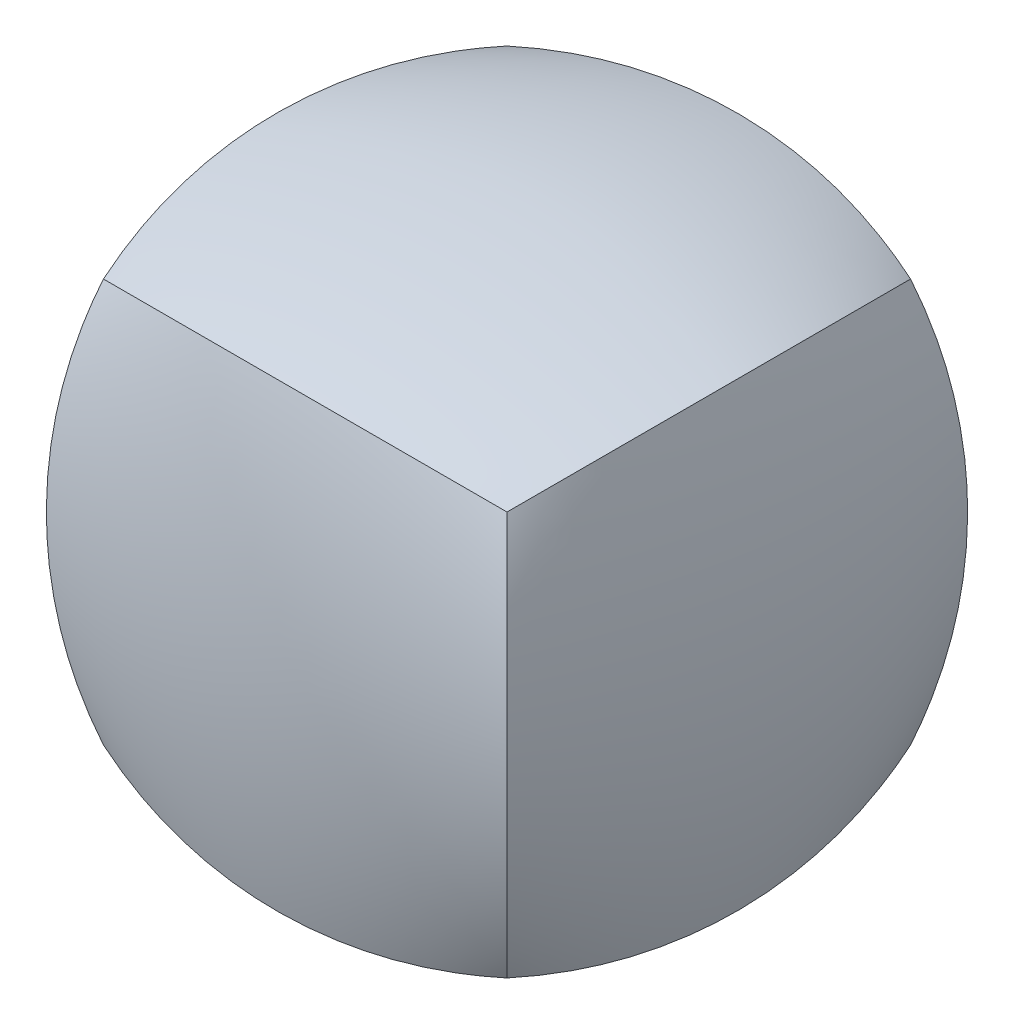
ISO-10303-21;
HEADER;
FILE_DESCRIPTION(('STEP AP214'),'2;1');
FILE_NAME('part.step','',(''),(''),'','','');
FILE_SCHEMA(('AUTOMOTIVE_DESIGN { 1 0 10303 214 1 1 1 1 }'));
ENDSEC;
DATA;
#1=APPLICATION_CONTEXT('core data for automotive mechanical design processes');
#2=APPLICATION_PROTOCOL_DEFINITION('international standard','automotive_design',2000,#1);
#3=PRODUCT_CONTEXT('',#1,'mechanical');
#4=PRODUCT('Part','Part','',(#3));
#5=PRODUCT_RELATED_PRODUCT_CATEGORY('part','',(#4));
#6=PRODUCT_DEFINITION_FORMATION('','',#4);
#7=PRODUCT_DEFINITION_CONTEXT('part definition',#1,'design');
#8=PRODUCT_DEFINITION('design','',#6,#7);
#9=PRODUCT_DEFINITION_SHAPE('','',#8);
#10=(LENGTH_UNIT() NAMED_UNIT(*) SI_UNIT(.MILLI.,.METRE.));
#11=(NAMED_UNIT(*) PLANE_ANGLE_UNIT() SI_UNIT($,.RADIAN.));
#12=(NAMED_UNIT(*) SI_UNIT($,.STERADIAN.) SOLID_ANGLE_UNIT());
#13=UNCERTAINTY_MEASURE_WITH_UNIT(LENGTH_MEASURE(1.E-05),#10,'distance_accuracy_value','');
#14=(GEOMETRIC_REPRESENTATION_CONTEXT(3) GLOBAL_UNCERTAINTY_ASSIGNED_CONTEXT((#13)) GLOBAL_UNIT_ASSIGNED_CONTEXT((#10,
#11,#12)) REPRESENTATION_CONTEXT('',''));
#15=CARTESIAN_POINT('',(0.,0.,0.));
#16=DIRECTION('',(0.,0.,1.));
#17=DIRECTION('',(1.,0.,0.));
#18=AXIS2_PLACEMENT_3D('',#15,#16,#17);
#19=CARTESIAN_POINT('',(12.6999999999999,-12.7000000000001,12.7000000000001));
#20=CARTESIAN_POINT('',(10.6944611119251,-13.290887561538,13.290887561538));
#21=CARTESIAN_POINT('',(6.51798434849319,-14.1918967287505,14.1918967287506));
#22=CARTESIAN_POINT('',(-2.10708044185823E-13,-14.6481905193401,14.6481905193401));
#23=CARTESIAN_POINT('',(-6.51798434849355,-14.1918967287504,14.1918967287505));
#24=CARTESIAN_POINT('',(-10.6944611119254,-13.2908875615378,13.2908875615378));
#25=CARTESIAN_POINT('',(-12.7000000000002,-12.6999999999999,12.6999999999999));
#26=CARTESIAN_POINT('',(13.2908875615378,-13.290887561538,10.6944611119253));
#27=CARTESIAN_POINT('',(11.177019287181,-13.8817751230759,11.1770192871812));
#28=CARTESIAN_POINT('',(6.79865594022371,-14.7827842902884,11.9128434404048));
#29=CARTESIAN_POINT('',(-2.02040606729286E-13,-15.239078080878,12.2854833693863));
#30=CARTESIAN_POINT('',(-6.79865594022405,-14.7827842902883,11.9128434404047));
#31=CARTESIAN_POINT('',(-11.1770192871814,-13.8817751230757,11.1770192871811));
#32=CARTESIAN_POINT('',(-13.2908875615381,-13.2908875615378,10.6944611119251));
#33=CARTESIAN_POINT('',(14.1918967287504,-14.1918967287506,6.51798434849343));
#34=CARTESIAN_POINT('',(11.9128434404046,-14.7827842902885,6.79865594022393));
#35=CARTESIAN_POINT('',(7.22663529464968,-15.683793457501,7.22663529464987));
#36=CARTESIAN_POINT('',(-1.87949322917618E-13,-16.1400872480906,7.44337484517988));
#37=CARTESIAN_POINT('',(-7.22663529465001,-15.6837934575009,7.22663529464978));
#38=CARTESIAN_POINT('',(-11.912843440405,-14.7827842902883,6.79865594022379));
#39=CARTESIAN_POINT('',(-14.1918967287507,-14.1918967287504,6.51798434849325));
#40=CARTESIAN_POINT('',(14.64819051934,-14.6481905193401,0.));
#41=CARTESIAN_POINT('',(12.2854833693862,-15.2390780808781,0.));
#42=CARTESIAN_POINT('',(7.44337484517978,-16.1400872480906,0.));
#43=CARTESIAN_POINT('',(-1.45815956462966E-13,-16.5963810386801,0.));
#44=CARTESIAN_POINT('',(-7.44337484518004,-16.1400872480905,0.));
#45=CARTESIAN_POINT('',(-12.2854833693864,-15.2390780808779,0.));
#46=CARTESIAN_POINT('',(-14.6481905193403,-14.64819051934,-1.11022302462516E-13));
#47=CARTESIAN_POINT('',(14.1918967287504,-14.1918967287506,-6.51798434849332));
#48=CARTESIAN_POINT('',(11.9128434404047,-14.7827842902885,-6.79865594022384));
#49=CARTESIAN_POINT('',(7.22663529464975,-15.683793457501,-7.22663529464985));
#50=CARTESIAN_POINT('',(-1.0403207476724E-13,-16.1400872480906,-7.44337484517992));
#51=CARTESIAN_POINT('',(-7.22663529464993,-15.6837934575009,-7.22663529464992));
#52=CARTESIAN_POINT('',(-11.9128434404049,-14.7827842902883,-6.79865594022396));
#53=CARTESIAN_POINT('',(-14.1918967287506,-14.1918967287504,-6.51798434849346));
#54=CARTESIAN_POINT('',(13.2908875615379,-13.290887561538,-10.6944611119252));
#55=CARTESIAN_POINT('',(11.1770192871811,-13.8817751230759,-11.1770192871812));
#56=CARTESIAN_POINT('',(6.79865594022381,-14.7827842902884,-11.9128434404048));
#57=CARTESIAN_POINT('',(0.,-15.239078080878,-12.2854833693863));
#58=CARTESIAN_POINT('',(-6.79865594022393,-14.7827842902883,-11.9128434404049));
#59=CARTESIAN_POINT('',(-11.1770192871812,-13.8817751230757,-11.1770192871813));
#60=CARTESIAN_POINT('',(-13.290887561538,-13.2908875615378,-10.6944611119253));
#61=CARTESIAN_POINT('',(12.7,-12.7000000000001,-12.7));
#62=CARTESIAN_POINT('',(10.6944611119252,-13.290887561538,-13.2908875615379));
#63=CARTESIAN_POINT('',(6.5179843484933,-14.1918967287505,-14.1918967287505));
#64=CARTESIAN_POINT('',(0.,-14.6481905193401,-14.6481905193401));
#65=CARTESIAN_POINT('',(-6.5179843484934,-14.1918967287504,-14.1918967287506));
#66=CARTESIAN_POINT('',(-10.6944611119253,-13.2908875615378,-13.290887561538));
#67=CARTESIAN_POINT('',(-12.7,-12.6999999999999,-12.7000000000001));
#68=B_SPLINE_SURFACE_WITH_KNOTS('',3,3,((#19,#20,#21,#22,#23,#24,#25),(#26,#27,#28,#29,#30,#31,
#32),(#33,#34,#35,#36,#37,#38,#39),(#40,#41,#42,#43,#44,#45,#46),(#47,#48,#49,#50,#51,#52,#53),
(#54,#55,#56,#57,#58,#59,#60),(#61,#62,#63,#64,#65,#66,#67)),.UNSPECIFIED.,.F.,.F.,.F.,(4,1,1,1,
4),(4,1,1,1,4),(0.,0.25,0.5,0.75,1.),(0.,0.25,0.5,0.75,1.),.UNSPECIFIED.);
#69=CARTESIAN_POINT('',(12.6999999999999,-12.7000000000002,12.6999999999999));
#70=CARTESIAN_POINT('',(13.2908875615379,-13.2908875615381,10.6944611119251));
#71=CARTESIAN_POINT('',(14.1918967287504,-14.1918967287506,6.51798434849325));
#72=CARTESIAN_POINT('',(14.64819051934,-14.6481905193402,-1.11022302462516E-13));
#73=CARTESIAN_POINT('',(14.1918967287504,-14.1918967287505,-6.51798434849346));
#74=CARTESIAN_POINT('',(13.2908875615379,-13.2908875615379,-10.6944611119253));
#75=CARTESIAN_POINT('',(12.6999999999999,-12.7,-12.7000000000001));
#76=B_SPLINE_CURVE_WITH_KNOTS('',3,(#69,#70,#71,#72,#73,#74,#75),.UNSPECIFIED.,.F.,.F.,(4,1,1,1,
4),(0.,0.25,0.5,0.75,1.),.UNSPECIFIED.);
#77=CARTESIAN_POINT('',(12.7,-12.7000000000001,12.6999999999999));
#78=VERTEX_POINT('',#77);
#79=CARTESIAN_POINT('',(12.6999999999999,-12.7,-12.7000000000001));
#80=VERTEX_POINT('',#79);
#81=EDGE_CURVE('E185',#78,#80,#76,.T.);
#82=CARTESIAN_POINT('',(-12.6999999999999,-12.7000000000001,12.6999999999999));
#83=CARTESIAN_POINT('',(-10.6944611119252,-13.290887561538,13.2908875615379));
#84=CARTESIAN_POINT('',(-6.51798434849328,-14.1918967287506,14.1918967287504));
#85=CARTESIAN_POINT('',(1.09906321039234E-13,-14.6481905193401,14.64819051934));
#86=CARTESIAN_POINT('',(6.51798434849346,-14.1918967287505,14.1918967287504));
#87=CARTESIAN_POINT('',(10.6944611119253,-13.2908875615379,13.2908875615379));
#88=CARTESIAN_POINT('',(12.7000000000001,-12.7,12.6999999999999));
#89=B_SPLINE_CURVE_WITH_KNOTS('',3,(#82,#83,#84,#85,#86,#87,#88),.UNSPECIFIED.,.F.,.F.,(4,1,1,1,
4),(0.,0.25,0.5,0.75,1.),.UNSPECIFIED.);
#90=CARTESIAN_POINT('',(-12.7000000000001,-12.7,12.6999999999999));
#91=VERTEX_POINT('',#90);
#92=EDGE_CURVE('E237',#91,#78,#89,.T.);
#93=CARTESIAN_POINT('',(-12.7000000000002,-12.6999999999999,12.6999999999999));
#94=CARTESIAN_POINT('',(-13.2908875615381,-13.2908875615378,10.6944611119251));
#95=CARTESIAN_POINT('',(-14.1918967287507,-14.1918967287504,6.51798434849325));
#96=CARTESIAN_POINT('',(-14.6481905193403,-14.64819051934,-1.11022302462516E-13));
#97=CARTESIAN_POINT('',(-14.1918967287506,-14.1918967287504,-6.51798434849346));
#98=CARTESIAN_POINT('',(-13.290887561538,-13.2908875615378,-10.6944611119253));
#99=CARTESIAN_POINT('',(-12.7,-12.6999999999999,-12.7000000000001));
#100=B_SPLINE_CURVE_WITH_KNOTS('',3,(#93,#94,#95,#96,#97,#98,#99),.UNSPECIFIED.,.F.,.F.,(4,1,1,
1,4),(0.,0.25,0.5,0.75,1.),.UNSPECIFIED.);
#101=CARTESIAN_POINT('',(-12.7,-12.7,-12.7));
#102=VERTEX_POINT('',#101);
#103=EDGE_CURVE('E241',#91,#102,#100,.T.);
#104=CARTESIAN_POINT('',(12.7,-12.7000000000001,-12.7));
#105=CARTESIAN_POINT('',(10.6944611119252,-13.290887561538,-13.2908875615379));
#106=CARTESIAN_POINT('',(6.5179843484933,-14.1918967287505,-14.1918967287505));
#107=CARTESIAN_POINT('',(0.,-14.6481905193401,-14.6481905193401));
#108=CARTESIAN_POINT('',(-6.5179843484934,-14.1918967287504,-14.1918967287506));
#109=CARTESIAN_POINT('',(-10.6944611119253,-13.2908875615378,-13.290887561538));
#110=CARTESIAN_POINT('',(-12.7,-12.6999999999999,-12.7000000000001));
#111=B_SPLINE_CURVE_WITH_KNOTS('',3,(#104,#105,#106,#107,#108,#109,#110),.UNSPECIFIED.,.F.,.F.,
(4,1,1,1,4),(0.,0.25,0.5,0.75,1.),.UNSPECIFIED.);
#112=EDGE_CURVE('E234',#102,#80,#111,.F.);
#113=ORIENTED_EDGE('',*,*,#81,.F.);
#114=ORIENTED_EDGE('',*,*,#92,.F.);
#115=ORIENTED_EDGE('',*,*,#103,.T.);
#116=ORIENTED_EDGE('',*,*,#112,.T.);
#117=EDGE_LOOP('',(#113,#114,#115,#116));
#118=FACE_BOUND('',#117,.T.);
#119=ADVANCED_FACE('F180',(#118),#68,.F.);
#120=CARTESIAN_POINT('',(12.7,12.6999999999999,12.7000000000001));
#121=CARTESIAN_POINT('',(13.2908875615379,10.6944611119251,13.290887561538));
#122=CARTESIAN_POINT('',(14.1918967287505,6.51798434849324,14.1918967287506));
#123=CARTESIAN_POINT('',(14.6481905193401,-1.59564130717186E-13,14.6481905193401));
#124=CARTESIAN_POINT('',(14.1918967287504,-6.5179843484935,14.1918967287505));
#125=CARTESIAN_POINT('',(13.2908875615379,-10.6944611119254,13.2908875615378));
#126=CARTESIAN_POINT('',(12.6999999999999,-12.7000000000002,12.6999999999999));
#127=CARTESIAN_POINT('',(13.2908875615379,13.2908875615378,10.6944611119253));
#128=CARTESIAN_POINT('',(13.8817751230759,11.1770192871811,11.1770192871812));
#129=CARTESIAN_POINT('',(14.7827842902884,6.79865594022376,11.9128434404048));
#130=CARTESIAN_POINT('',(15.239078080878,-1.48833619171254E-13,12.2854833693863));
#131=CARTESIAN_POINT('',(14.7827842902884,-6.798655940224,11.9128434404047));
#132=CARTESIAN_POINT('',(13.8817751230758,-11.1770192871813,11.1770192871811));
#133=CARTESIAN_POINT('',(13.2908875615379,-13.2908875615381,10.6944611119251));
#134=CARTESIAN_POINT('',(14.1918967287505,14.1918967287504,6.51798434849343));
#135=CARTESIAN_POINT('',(14.7827842902885,11.9128434404047,6.79865594022393));
#136=CARTESIAN_POINT('',(15.683793457501,7.22663529464974,7.22663529464987));
#137=CARTESIAN_POINT('',(16.1400872480906,-1.31596476844056E-13,7.44337484517988));
#138=CARTESIAN_POINT('',(15.6837934575009,-7.22663529464996,7.22663529464978));
#139=CARTESIAN_POINT('',(14.7827842902884,-11.9128434404049,6.79865594022379));
#140=CARTESIAN_POINT('',(14.1918967287504,-14.1918967287506,6.51798434849325));
#141=CARTESIAN_POINT('',(14.6481905193401,14.6481905193401,0.));
#142=CARTESIAN_POINT('',(15.239078080878,12.2854833693862,0.));
#143=CARTESIAN_POINT('',(16.1400872480906,7.44337484517984,0.));
#144=CARTESIAN_POINT('',(16.5963810386801,0.,0.));
#145=CARTESIAN_POINT('',(16.1400872480905,-7.44337484517999,0.));
#146=CARTESIAN_POINT('',(15.2390780808779,-12.2854833693864,0.));
#147=CARTESIAN_POINT('',(14.64819051934,-14.6481905193402,-1.11022302462516E-13));
#148=CARTESIAN_POINT('',(14.1918967287505,14.1918967287505,-6.51798434849332));
#149=CARTESIAN_POINT('',(14.7827842902884,11.9128434404047,-6.79865594022384));
#150=CARTESIAN_POINT('',(15.683793457501,7.2266352946498,-7.22663529464985));
#151=CARTESIAN_POINT('',(16.1400872480906,0.,-7.44337484517992));
#152=CARTESIAN_POINT('',(15.6837934575009,-7.22663529464988,-7.22663529464992));
#153=CARTESIAN_POINT('',(14.7827842902884,-11.9128434404048,-6.79865594022396));
#154=CARTESIAN_POINT('',(14.1918967287504,-14.1918967287505,-6.51798434849346));
#155=CARTESIAN_POINT('',(13.290887561538,13.2908875615379,-10.6944611119252));
#156=CARTESIAN_POINT('',(13.8817751230759,11.1770192871812,-11.1770192871812));
#157=CARTESIAN_POINT('',(14.7827842902884,6.79865594022386,-11.9128434404048));
#158=CARTESIAN_POINT('',(15.239078080878,0.,-12.2854833693863));
#159=CARTESIAN_POINT('',(14.7827842902884,-6.79865594022388,-11.9128434404049));
#160=CARTESIAN_POINT('',(13.8817751230758,-11.1770192871812,-11.1770192871813));
#161=CARTESIAN_POINT('',(13.2908875615379,-13.2908875615379,-10.6944611119253));
#162=CARTESIAN_POINT('',(12.7,12.7,-12.7));
#163=CARTESIAN_POINT('',(13.2908875615379,10.6944611119252,-13.2908875615379));
#164=CARTESIAN_POINT('',(14.1918967287505,6.51798434849335,-14.1918967287505));
#165=CARTESIAN_POINT('',(14.6481905193401,0.,-14.6481905193401));
#166=CARTESIAN_POINT('',(14.1918967287505,-6.51798434849335,-14.1918967287506));
#167=CARTESIAN_POINT('',(13.2908875615379,-10.6944611119252,-13.290887561538));
#168=CARTESIAN_POINT('',(12.6999999999999,-12.7,-12.7000000000001));
#169=B_SPLINE_SURFACE_WITH_KNOTS('',3,3,((#120,#121,#122,#123,#124,#125,#126),(#127,#128,#129,
#130,#131,#132,#133),(#134,#135,#136,#137,#138,#139,#140),(#141,#142,#143,#144,#145,#146,#147),
(#148,#149,#150,#151,#152,#153,#154),(#155,#156,#157,#158,#159,#160,#161),(#162,#163,#164,#165,
#166,#167,#168)),.UNSPECIFIED.,.F.,.F.,.F.,(4,1,1,1,4),(4,1,1,1,4),(0.,0.25,0.5,0.75,1.),(0.,
0.25,0.5,0.75,1.),.UNSPECIFIED.);
#170=CARTESIAN_POINT('',(12.7000000000001,12.7,12.6999999999999));
#171=CARTESIAN_POINT('',(13.290887561538,13.2908875615379,10.6944611119251));
#172=CARTESIAN_POINT('',(14.1918967287506,14.1918967287505,6.51798434849325));
#173=CARTESIAN_POINT('',(14.6481905193402,14.6481905193401,-1.11022302462516E-13));
#174=CARTESIAN_POINT('',(14.1918967287505,14.1918967287505,-6.51798434849346));
#175=CARTESIAN_POINT('',(13.2908875615379,13.2908875615379,-10.6944611119253));
#176=CARTESIAN_POINT('',(12.7,12.7,-12.7000000000001));
#177=B_SPLINE_CURVE_WITH_KNOTS('',3,(#170,#171,#172,#173,#174,#175,#176),.UNSPECIFIED.,.F.,.F.,
(4,1,1,1,4),(0.,0.25,0.5,0.75,1.),.UNSPECIFIED.);
#178=CARTESIAN_POINT('',(12.7,12.7,12.7));
#179=VERTEX_POINT('',#178);
#180=CARTESIAN_POINT('',(12.7,12.7,-12.7));
#181=VERTEX_POINT('',#180);
#182=EDGE_CURVE('E287',#179,#181,#177,.T.);
#183=CARTESIAN_POINT('',(12.7000000000001,-12.7,12.6999999999999));
#184=CARTESIAN_POINT('',(13.290887561538,-10.6944611119252,13.2908875615379));
#185=CARTESIAN_POINT('',(14.1918967287506,-6.51798434849331,14.1918967287504));
#186=CARTESIAN_POINT('',(14.6481905193402,0.,14.6481905193401));
#187=CARTESIAN_POINT('',(14.1918967287505,6.51798434849341,14.1918967287505));
#188=CARTESIAN_POINT('',(13.2908875615379,10.6944611119252,13.2908875615379));
#189=CARTESIAN_POINT('',(12.7,12.7,12.7));
#190=B_SPLINE_CURVE_WITH_KNOTS('',3,(#183,#184,#185,#186,#187,#188,#189),.UNSPECIFIED.,.F.,.F.,
(4,1,1,1,4),(0.,0.25,0.5,0.75,1.),.UNSPECIFIED.);
#191=EDGE_CURVE('E230',#78,#179,#190,.T.);
#192=CARTESIAN_POINT('',(12.7,12.7,-12.7));
#193=CARTESIAN_POINT('',(13.2908875615379,10.6944611119252,-13.2908875615379));
#194=CARTESIAN_POINT('',(14.1918967287505,6.51798434849335,-14.1918967287505));
#195=CARTESIAN_POINT('',(14.6481905193401,0.,-14.6481905193401));
#196=CARTESIAN_POINT('',(14.1918967287505,-6.51798434849335,-14.1918967287506));
#197=CARTESIAN_POINT('',(13.2908875615379,-10.6944611119252,-13.290887561538));
#198=CARTESIAN_POINT('',(12.6999999999999,-12.7,-12.7000000000001));
#199=B_SPLINE_CURVE_WITH_KNOTS('',3,(#192,#193,#194,#195,#196,#197,#198),.UNSPECIFIED.,.F.,.F.,
(4,1,1,1,4),(0.,0.25,0.5,0.75,1.),.UNSPECIFIED.);
#200=EDGE_CURVE('E229',#80,#181,#199,.F.);
#201=ORIENTED_EDGE('',*,*,#182,.F.);
#202=ORIENTED_EDGE('',*,*,#191,.F.);
#203=ORIENTED_EDGE('',*,*,#81,.T.);
#204=ORIENTED_EDGE('',*,*,#200,.T.);
#205=EDGE_LOOP('',(#201,#202,#203,#204));
#206=FACE_BOUND('',#205,.T.);
#207=ADVANCED_FACE('F228',(#206),#169,.F.);
#208=CARTESIAN_POINT('',(-12.6999999999999,-12.7000000000001,12.6999999999999));
#209=CARTESIAN_POINT('',(-10.6944611119252,-13.290887561538,13.2908875615379));
#210=CARTESIAN_POINT('',(-6.51798434849328,-14.1918967287506,14.1918967287504));
#211=CARTESIAN_POINT('',(1.09906321039234E-13,-14.6481905193401,14.64819051934));
#212=CARTESIAN_POINT('',(6.51798434849346,-14.1918967287505,14.1918967287504));
#213=CARTESIAN_POINT('',(10.6944611119253,-13.2908875615379,13.2908875615379));
#214=CARTESIAN_POINT('',(12.7000000000001,-12.7,12.6999999999999));
#215=CARTESIAN_POINT('',(-13.2908875615379,-10.6944611119253,13.2908875615379));
#216=CARTESIAN_POINT('',(-11.1770192871811,-11.1770192871813,13.8817751230758));
#217=CARTESIAN_POINT('',(-6.79865594022381,-11.9128434404049,14.7827842902883));
#218=CARTESIAN_POINT('',(0.,-12.2854833693863,15.2390780808779));
#219=CARTESIAN_POINT('',(6.79865594022395,-11.9128434404048,14.7827842902883));
#220=CARTESIAN_POINT('',(11.1770192871813,-11.1770192871812,13.8817751230758));
#221=CARTESIAN_POINT('',(13.290887561538,-10.6944611119252,13.2908875615379));
#222=CARTESIAN_POINT('',(-14.1918967287505,-6.51798434849349,14.1918967287505));
#223=CARTESIAN_POINT('',(-11.9128434404047,-6.79865594022399,14.7827842902884));
#224=CARTESIAN_POINT('',(-7.22663529464979,-7.22663529464994,15.6837934575009));
#225=CARTESIAN_POINT('',(0.,-7.44337484517995,16.1400872480905));
#226=CARTESIAN_POINT('',(7.2266352946499,-7.22663529464985,15.6837934575009));
#227=CARTESIAN_POINT('',(11.9128434404049,-6.79865594022385,14.7827842902884));
#228=CARTESIAN_POINT('',(14.1918967287506,-6.51798434849331,14.1918967287504));
#229=CARTESIAN_POINT('',(-14.6481905193401,-1.02657068975964E-13,14.64819051934));
#230=CARTESIAN_POINT('',(-12.2854833693863,0.,15.239078080878));
#231=CARTESIAN_POINT('',(-7.4433748451799,0.,16.1400872480905));
#232=CARTESIAN_POINT('',(0.,0.,16.5963810386801));
#233=CARTESIAN_POINT('',(7.44337484517993,0.,16.1400872480905));
#234=CARTESIAN_POINT('',(12.2854833693863,0.,15.239078080878));
#235=CARTESIAN_POINT('',(14.6481905193402,0.,14.6481905193401));
#236=CARTESIAN_POINT('',(-14.1918967287505,6.51798434849326,14.1918967287505));
#237=CARTESIAN_POINT('',(-11.9128434404048,6.79865594022378,14.7827842902884));
#238=CARTESIAN_POINT('',(-7.22663529464986,7.22663529464979,15.683793457501));
#239=CARTESIAN_POINT('',(0.,7.44337484517985,16.1400872480906));
#240=CARTESIAN_POINT('',(7.22663529464982,7.22663529464986,15.683793457501));
#241=CARTESIAN_POINT('',(11.9128434404048,6.7986559402239,14.7827842902884));
#242=CARTESIAN_POINT('',(14.1918967287505,6.51798434849341,14.1918967287505));
#243=CARTESIAN_POINT('',(-13.290887561538,10.6944611119251,13.2908875615379));
#244=CARTESIAN_POINT('',(-11.1770192871812,11.1770192871811,13.8817751230759));
#245=CARTESIAN_POINT('',(-6.79865594022391,11.9128434404048,14.7827842902884));
#246=CARTESIAN_POINT('',(0.,12.2854833693863,15.239078080878));
#247=CARTESIAN_POINT('',(6.79865594022383,11.9128434404048,14.7827842902884));
#248=CARTESIAN_POINT('',(11.1770192871811,11.1770192871812,13.8817751230759));
#249=CARTESIAN_POINT('',(13.2908875615379,10.6944611119252,13.2908875615379));
#250=CARTESIAN_POINT('',(-12.7,12.6999999999999,12.7));
#251=CARTESIAN_POINT('',(-10.6944611119253,13.2908875615379,13.290887561538));
#252=CARTESIAN_POINT('',(-6.5179843484934,14.1918967287505,14.1918967287505));
#253=CARTESIAN_POINT('',(0.,14.6481905193401,14.6481905193401));
#254=CARTESIAN_POINT('',(6.5179843484933,14.1918967287505,14.1918967287505));
#255=CARTESIAN_POINT('',(10.6944611119252,13.2908875615379,13.290887561538));
#256=CARTESIAN_POINT('',(12.7,12.7,12.7));
#257=B_SPLINE_SURFACE_WITH_KNOTS('',3,3,((#208,#209,#210,#211,#212,#213,#214),(#215,#216,#217,
#218,#219,#220,#221),(#222,#223,#224,#225,#226,#227,#228),(#229,#230,#231,#232,#233,#234,#235),
(#236,#237,#238,#239,#240,#241,#242),(#243,#244,#245,#246,#247,#248,#249),(#250,#251,#252,#253,
#254,#255,#256)),.UNSPECIFIED.,.F.,.F.,.F.,(4,1,1,1,4),(4,1,1,1,4),(0.,0.25,0.5,0.75,1.),(0.,
0.25,0.5,0.75,1.),.UNSPECIFIED.);
#258=CARTESIAN_POINT('',(-12.7000000000001,-12.6999999999998,12.7000000000001));
#259=CARTESIAN_POINT('',(-13.290887561538,-10.694461111925,13.290887561538));
#260=CARTESIAN_POINT('',(-14.1918967287505,-6.51798434849314,14.1918967287506));
#261=CARTESIAN_POINT('',(-14.6481905193401,2.61851957654459E-13,14.6481905193401));
#262=CARTESIAN_POINT('',(-14.1918967287504,6.5179843484936,14.1918967287505));
#263=CARTESIAN_POINT('',(-13.2908875615378,10.6944611119255,13.2908875615378));
#264=CARTESIAN_POINT('',(-12.6999999999998,12.7000000000003,12.6999999999999));
#265=B_SPLINE_CURVE_WITH_KNOTS('',3,(#258,#259,#260,#261,#262,#263,#264),.UNSPECIFIED.,.F.,.F.,
(4,1,1,1,4),(0.,0.25,0.5,0.75,1.),.UNSPECIFIED.);
#266=CARTESIAN_POINT('',(-12.6999999999998,12.7000000000003,12.6999999999999));
#267=VERTEX_POINT('',#266);
#268=EDGE_CURVE('E243',#91,#267,#265,.T.);
#269=CARTESIAN_POINT('',(-12.7,12.7,12.7000000000001));
#270=CARTESIAN_POINT('',(-10.6944611119252,13.2908875615379,13.290887561538));
#271=CARTESIAN_POINT('',(-6.51798434849329,14.1918967287505,14.1918967287506));
#272=CARTESIAN_POINT('',(1.0842021724855E-13,14.6481905193401,14.6481905193401));
#273=CARTESIAN_POINT('',(6.51798434849345,14.1918967287505,14.1918967287505));
#274=CARTESIAN_POINT('',(10.6944611119253,13.2908875615379,13.2908875615378));
#275=CARTESIAN_POINT('',(12.7000000000001,12.7,12.6999999999999));
#276=B_SPLINE_CURVE_WITH_KNOTS('',3,(#269,#270,#271,#272,#273,#274,#275),.UNSPECIFIED.,.F.,.F.,
(4,1,1,1,4),(0.,0.25,0.5,0.75,1.),.UNSPECIFIED.);
#277=EDGE_CURVE('E285',#267,#179,#276,.T.);
#278=ORIENTED_EDGE('',*,*,#268,.F.);
#279=ORIENTED_EDGE('',*,*,#92,.T.);
#280=ORIENTED_EDGE('',*,*,#191,.T.);
#281=ORIENTED_EDGE('',*,*,#277,.F.);
#282=EDGE_LOOP('',(#278,#279,#280,#281));
#283=FACE_BOUND('',#282,.T.);
#284=ADVANCED_FACE('F284',(#283),#257,.F.);
#285=CARTESIAN_POINT('',(-12.6999999999999,-12.7000000000001,-12.6999999999999));
#286=CARTESIAN_POINT('',(-10.6944611119252,-13.290887561538,-13.2908875615379));
#287=CARTESIAN_POINT('',(-6.51798434849328,-14.1918967287506,-14.1918967287504));
#288=CARTESIAN_POINT('',(1.09906321039234E-13,-14.6481905193401,-14.64819051934));
#289=CARTESIAN_POINT('',(6.51798434849346,-14.1918967287505,-14.1918967287504));
#290=CARTESIAN_POINT('',(10.6944611119253,-13.2908875615379,-13.2908875615379));
#291=CARTESIAN_POINT('',(12.7000000000001,-12.7,-12.6999999999999));
#292=CARTESIAN_POINT('',(-13.2908875615379,-10.6944611119253,-13.2908875615379));
#293=CARTESIAN_POINT('',(-11.1770192871811,-11.1770192871813,-13.8817751230758));
#294=CARTESIAN_POINT('',(-6.79865594022381,-11.9128434404049,-14.7827842902883));
#295=CARTESIAN_POINT('',(0.,-12.2854833693863,-15.2390780808779));
#296=CARTESIAN_POINT('',(6.79865594022395,-11.9128434404048,-14.7827842902883));
#297=CARTESIAN_POINT('',(11.1770192871813,-11.1770192871812,-13.8817751230758));
#298=CARTESIAN_POINT('',(13.290887561538,-10.6944611119252,-13.2908875615379));
#299=CARTESIAN_POINT('',(-14.1918967287505,-6.51798434849349,-14.1918967287505));
#300=CARTESIAN_POINT('',(-11.9128434404047,-6.79865594022399,-14.7827842902884));
#301=CARTESIAN_POINT('',(-7.22663529464979,-7.22663529464994,-15.6837934575009));
#302=CARTESIAN_POINT('',(0.,-7.44337484517995,-16.1400872480905));
#303=CARTESIAN_POINT('',(7.2266352946499,-7.22663529464985,-15.6837934575009));
#304=CARTESIAN_POINT('',(11.9128434404049,-6.79865594022385,-14.7827842902884));
#305=CARTESIAN_POINT('',(14.1918967287506,-6.51798434849331,-14.1918967287504));
#306=CARTESIAN_POINT('',(-14.6481905193401,-1.02657068975964E-13,-14.64819051934));
#307=CARTESIAN_POINT('',(-12.2854833693863,0.,-15.239078080878));
#308=CARTESIAN_POINT('',(-7.4433748451799,0.,-16.1400872480905));
#309=CARTESIAN_POINT('',(0.,0.,-16.5963810386801));
#310=CARTESIAN_POINT('',(7.44337484517993,0.,-16.1400872480905));
#311=CARTESIAN_POINT('',(12.2854833693863,0.,-15.239078080878));
#312=CARTESIAN_POINT('',(14.6481905193402,0.,-14.6481905193401));
#313=CARTESIAN_POINT('',(-14.1918967287505,6.51798434849326,-14.1918967287505));
#314=CARTESIAN_POINT('',(-11.9128434404048,6.79865594022378,-14.7827842902884));
#315=CARTESIAN_POINT('',(-7.22663529464986,7.22663529464979,-15.683793457501));
#316=CARTESIAN_POINT('',(0.,7.44337484517985,-16.1400872480906));
#317=CARTESIAN_POINT('',(7.22663529464982,7.22663529464986,-15.683793457501));
#318=CARTESIAN_POINT('',(11.9128434404048,6.7986559402239,-14.7827842902884));
#319=CARTESIAN_POINT('',(14.1918967287505,6.51798434849341,-14.1918967287505));
#320=CARTESIAN_POINT('',(-13.290887561538,10.6944611119251,-13.2908875615379));
#321=CARTESIAN_POINT('',(-11.1770192871812,11.1770192871811,-13.8817751230759));
#322=CARTESIAN_POINT('',(-6.79865594022391,11.9128434404048,-14.7827842902884));
#323=CARTESIAN_POINT('',(0.,12.2854833693863,-15.239078080878));
#324=CARTESIAN_POINT('',(6.79865594022383,11.9128434404048,-14.7827842902884));
#325=CARTESIAN_POINT('',(11.1770192871811,11.1770192871812,-13.8817751230759));
#326=CARTESIAN_POINT('',(13.2908875615379,10.6944611119252,-13.2908875615379));
#327=CARTESIAN_POINT('',(-12.7,12.6999999999999,-12.7));
#328=CARTESIAN_POINT('',(-10.6944611119253,13.2908875615379,-13.290887561538));
#329=CARTESIAN_POINT('',(-6.5179843484934,14.1918967287505,-14.1918967287505));
#330=CARTESIAN_POINT('',(0.,14.6481905193401,-14.6481905193401));
#331=CARTESIAN_POINT('',(6.5179843484933,14.1918967287505,-14.1918967287505));
#332=CARTESIAN_POINT('',(10.6944611119252,13.2908875615379,-13.290887561538));
#333=CARTESIAN_POINT('',(12.7,12.7,-12.7));
#334=B_SPLINE_SURFACE_WITH_KNOTS('',3,3,((#285,#286,#287,#288,#289,#290,#291),(#292,#293,#294,
#295,#296,#297,#298),(#299,#300,#301,#302,#303,#304,#305),(#306,#307,#308,#309,#310,#311,#312),
(#313,#314,#315,#316,#317,#318,#319),(#320,#321,#322,#323,#324,#325,#326),(#327,#328,#329,#330,
#331,#332,#333)),.UNSPECIFIED.,.F.,.F.,.F.,(4,1,1,1,4),(4,1,1,1,4),(0.,0.25,0.5,0.75,1.),(0.,
0.25,0.5,0.75,1.),.UNSPECIFIED.);
#335=CARTESIAN_POINT('',(-12.6999999999999,-12.7000000000001,-12.6999999999999));
#336=CARTESIAN_POINT('',(-13.2908875615379,-10.6944611119253,-13.2908875615379));
#337=CARTESIAN_POINT('',(-14.1918967287505,-6.51798434849349,-14.1918967287505));
#338=CARTESIAN_POINT('',(-14.6481905193401,-1.02657068975964E-13,-14.64819051934));
#339=CARTESIAN_POINT('',(-14.1918967287505,6.51798434849326,-14.1918967287505));
#340=CARTESIAN_POINT('',(-13.290887561538,10.6944611119251,-13.2908875615379));
#341=CARTESIAN_POINT('',(-12.7,12.6999999999999,-12.7));
#342=B_SPLINE_CURVE_WITH_KNOTS('',3,(#335,#336,#337,#338,#339,#340,#341),.UNSPECIFIED.,.F.,.F.,
(4,1,1,1,4),(0.,0.25,0.5,0.75,1.),.UNSPECIFIED.);
#343=CARTESIAN_POINT('',(-12.7,12.6999999999999,-12.7));
#344=VERTEX_POINT('',#343);
#345=EDGE_CURVE('E249',#102,#344,#342,.T.);
#346=CARTESIAN_POINT('',(-12.7,12.6999999999999,-12.7));
#347=CARTESIAN_POINT('',(-10.6944611119253,13.2908875615379,-13.290887561538));
#348=CARTESIAN_POINT('',(-6.5179843484934,14.1918967287505,-14.1918967287505));
#349=CARTESIAN_POINT('',(0.,14.6481905193401,-14.6481905193401));
#350=CARTESIAN_POINT('',(6.5179843484933,14.1918967287505,-14.1918967287505));
#351=CARTESIAN_POINT('',(10.6944611119252,13.2908875615379,-13.290887561538));
#352=CARTESIAN_POINT('',(12.7,12.7,-12.7));
#353=B_SPLINE_CURVE_WITH_KNOTS('',3,(#346,#347,#348,#349,#350,#351,#352),.UNSPECIFIED.,.F.,.F.,
(4,1,1,1,4),(0.,0.25,0.5,0.75,1.),.UNSPECIFIED.);
#354=EDGE_CURVE('E194',#344,#181,#353,.T.);
#355=ORIENTED_EDGE('',*,*,#345,.T.);
#356=ORIENTED_EDGE('',*,*,#354,.T.);
#357=ORIENTED_EDGE('',*,*,#200,.F.);
#358=ORIENTED_EDGE('',*,*,#112,.F.);
#359=EDGE_LOOP('',(#355,#356,#357,#358));
#360=FACE_BOUND('',#359,.T.);
#361=ADVANCED_FACE('F233',(#360),#334,.T.);
#362=CARTESIAN_POINT('',(-12.7000000000001,-12.6999999999998,12.7000000000001));
#363=CARTESIAN_POINT('',(-13.290887561538,-10.694461111925,13.290887561538));
#364=CARTESIAN_POINT('',(-14.1918967287505,-6.51798434849314,14.1918967287506));
#365=CARTESIAN_POINT('',(-14.6481905193401,2.61851957654459E-13,14.6481905193401));
#366=CARTESIAN_POINT('',(-14.1918967287504,6.5179843484936,14.1918967287505));
#367=CARTESIAN_POINT('',(-13.2908875615378,10.6944611119255,13.2908875615378));
#368=CARTESIAN_POINT('',(-12.6999999999998,12.7000000000003,12.6999999999999));
#369=CARTESIAN_POINT('',(-13.290887561538,-13.2908875615377,10.6944611119253));
#370=CARTESIAN_POINT('',(-13.8817751230759,-11.177019287181,11.1770192871812));
#371=CARTESIAN_POINT('',(-14.7827842902885,-6.79865594022365,11.9128434404048));
#372=CARTESIAN_POINT('',(-15.239078080878,2.55247594287318E-13,12.2854833693863));
#373=CARTESIAN_POINT('',(-14.7827842902883,6.79865594022411,11.9128434404047));
#374=CARTESIAN_POINT('',(-13.8817751230757,11.1770192871814,11.1770192871811));
#375=CARTESIAN_POINT('',(-13.2908875615378,13.2908875615382,10.6944611119251));
#376=CARTESIAN_POINT('',(-14.1918967287506,-14.1918967287503,6.51798434849343));
#377=CARTESIAN_POINT('',(-14.7827842902885,-11.9128434404046,6.79865594022393));
#378=CARTESIAN_POINT('',(-15.6837934575011,-7.22663529464963,7.22663529464987));
#379=CARTESIAN_POINT('',(-16.1400872480906,2.4430216899118E-13,7.44337484517988));
#380=CARTESIAN_POINT('',(-15.6837934575009,7.22663529465007,7.22663529464978));
#381=CARTESIAN_POINT('',(-14.7827842902883,11.912843440405,6.79865594022379));
#382=CARTESIAN_POINT('',(-14.1918967287503,14.1918967287507,6.51798434849325));
#383=CARTESIAN_POINT('',(-14.6481905193402,-14.64819051934,0.));
#384=CARTESIAN_POINT('',(-15.2390780808781,-12.2854833693861,0.));
#385=CARTESIAN_POINT('',(-16.1400872480906,-7.44337484517973,0.));
#386=CARTESIAN_POINT('',(-16.5963810386801,2.03761944714149E-13,0.));
#387=CARTESIAN_POINT('',(-16.1400872480905,7.4433748451801,0.));
#388=CARTESIAN_POINT('',(-15.2390780808779,12.2854833693865,0.));
#389=CARTESIAN_POINT('',(-14.6481905193399,14.6481905193403,-1.11022302462516E-13));
#390=CARTESIAN_POINT('',(-14.1918967287506,-14.1918967287504,-6.51798434849332));
#391=CARTESIAN_POINT('',(-14.7827842902885,-11.9128434404046,-6.79865594022384));
#392=CARTESIAN_POINT('',(-15.6837934575011,-7.22663529464969,-7.22663529464985));
#393=CARTESIAN_POINT('',(-16.1400872480906,1.60384920840802E-13,-7.44337484517992));
#394=CARTESIAN_POINT('',(-15.6837934575009,7.22663529464999,-7.22663529464992));
#395=CARTESIAN_POINT('',(-14.7827842902883,11.9128434404049,-6.79865594022396));
#396=CARTESIAN_POINT('',(-14.1918967287503,14.1918967287506,-6.51798434849346));
#397=CARTESIAN_POINT('',(-13.290887561538,-13.2908875615378,-10.6944611119252));
#398=CARTESIAN_POINT('',(-13.8817751230759,-11.1770192871811,-11.1770192871812));
#399=CARTESIAN_POINT('',(-14.7827842902885,-6.79865594022375,-11.9128434404048));
#400=CARTESIAN_POINT('',(-15.239078080878,1.1972232272663E-13,-12.2854833693863));
#401=CARTESIAN_POINT('',(-14.7827842902883,6.79865594022399,-11.9128434404049));
#402=CARTESIAN_POINT('',(-13.8817751230757,11.1770192871813,-11.1770192871813));
#403=CARTESIAN_POINT('',(-13.2908875615378,13.290887561538,-10.6944611119253));
#404=CARTESIAN_POINT('',(-12.7000000000001,-12.6999999999999,-12.7));
#405=CARTESIAN_POINT('',(-13.290887561538,-10.6944611119251,-13.2908875615379));
#406=CARTESIAN_POINT('',(-14.1918967287505,-6.51798434849325,-14.1918967287505));
#407=CARTESIAN_POINT('',(-14.6481905193401,1.03124759602581E-13,-14.6481905193401));
#408=CARTESIAN_POINT('',(-14.1918967287504,6.51798434849345,-14.1918967287506));
#409=CARTESIAN_POINT('',(-13.2908875615378,10.6944611119253,-13.290887561538));
#410=CARTESIAN_POINT('',(-12.6999999999998,12.7000000000001,-12.7000000000001));
#411=B_SPLINE_SURFACE_WITH_KNOTS('',3,3,((#362,#363,#364,#365,#366,#367,#368),(#369,#370,#371,
#372,#373,#374,#375),(#376,#377,#378,#379,#380,#381,#382),(#383,#384,#385,#386,#387,#388,#389),
(#390,#391,#392,#393,#394,#395,#396),(#397,#398,#399,#400,#401,#402,#403),(#404,#405,#406,#407,
#408,#409,#410)),.UNSPECIFIED.,.F.,.F.,.F.,(4,1,1,1,4),(4,1,1,1,4),(0.,0.25,0.5,0.75,1.),(0.,
0.25,0.5,0.75,1.),.UNSPECIFIED.);
#412=CARTESIAN_POINT('',(-12.6999999999998,12.7000000000003,12.6999999999999));
#413=CARTESIAN_POINT('',(-13.2908875615378,13.2908875615382,10.6944611119251));
#414=CARTESIAN_POINT('',(-14.1918967287503,14.1918967287507,6.51798434849325));
#415=CARTESIAN_POINT('',(-14.6481905193399,14.6481905193403,-1.11022302462516E-13));
#416=CARTESIAN_POINT('',(-14.1918967287503,14.1918967287506,-6.51798434849346));
#417=CARTESIAN_POINT('',(-13.2908875615378,13.290887561538,-10.6944611119253));
#418=CARTESIAN_POINT('',(-12.6999999999998,12.7000000000001,-12.7000000000001));
#419=B_SPLINE_CURVE_WITH_KNOTS('',3,(#412,#413,#414,#415,#416,#417,#418),.UNSPECIFIED.,.F.,.F.,
(4,1,1,1,4),(0.,0.25,0.5,0.75,1.),.UNSPECIFIED.);
#420=EDGE_CURVE('E12',#267,#344,#419,.T.);
#421=ORIENTED_EDGE('',*,*,#103,.F.);
#422=ORIENTED_EDGE('',*,*,#268,.T.);
#423=ORIENTED_EDGE('',*,*,#420,.T.);
#424=ORIENTED_EDGE('',*,*,#345,.F.);
#425=EDGE_LOOP('',(#421,#422,#423,#424));
#426=FACE_BOUND('',#425,.T.);
#427=ADVANCED_FACE('F321',(#426),#411,.F.);
#428=CARTESIAN_POINT('',(-12.7,12.7,12.7000000000001));
#429=CARTESIAN_POINT('',(-10.6944611119252,13.2908875615379,13.290887561538));
#430=CARTESIAN_POINT('',(-6.51798434849329,14.1918967287505,14.1918967287506));
#431=CARTESIAN_POINT('',(1.0842021724855E-13,14.6481905193401,14.6481905193401));
#432=CARTESIAN_POINT('',(6.51798434849345,14.1918967287505,14.1918967287505));
#433=CARTESIAN_POINT('',(10.6944611119253,13.2908875615379,13.2908875615378));
#434=CARTESIAN_POINT('',(12.7000000000001,12.7,12.6999999999999));
#435=CARTESIAN_POINT('',(-13.2908875615379,13.2908875615379,10.6944611119253));
#436=CARTESIAN_POINT('',(-11.1770192871811,13.8817751230758,11.1770192871812));
#437=CARTESIAN_POINT('',(-6.79865594022381,14.7827842902884,11.9128434404048));
#438=CARTESIAN_POINT('',(0.,15.239078080878,12.2854833693863));
#439=CARTESIAN_POINT('',(6.79865594022395,14.7827842902884,11.9128434404047));
#440=CARTESIAN_POINT('',(11.1770192871813,13.8817751230758,11.1770192871811));
#441=CARTESIAN_POINT('',(13.290887561538,13.2908875615379,10.6944611119251));
#442=CARTESIAN_POINT('',(-14.1918967287505,14.1918967287505,6.51798434849343));
#443=CARTESIAN_POINT('',(-11.9128434404047,14.7827842902884,6.79865594022393));
#444=CARTESIAN_POINT('',(-7.22663529464979,15.683793457501,7.22663529464987));
#445=CARTESIAN_POINT('',(0.,16.1400872480906,7.44337484517988));
#446=CARTESIAN_POINT('',(7.2266352946499,15.683793457501,7.22663529464978));
#447=CARTESIAN_POINT('',(11.9128434404049,14.7827842902884,6.79865594022379));
#448=CARTESIAN_POINT('',(14.1918967287506,14.1918967287505,6.51798434849325));
#449=CARTESIAN_POINT('',(-14.6481905193401,14.64819051934,0.));
#450=CARTESIAN_POINT('',(-12.2854833693863,15.239078080878,0.));
#451=CARTESIAN_POINT('',(-7.4433748451799,16.1400872480905,0.));
#452=CARTESIAN_POINT('',(0.,16.5963810386801,0.));
#453=CARTESIAN_POINT('',(7.44337484517993,16.1400872480905,0.));
#454=CARTESIAN_POINT('',(12.2854833693863,15.239078080878,0.));
#455=CARTESIAN_POINT('',(14.6481905193402,14.6481905193401,-1.11022302462516E-13));
#456=CARTESIAN_POINT('',(-14.1918967287505,14.1918967287505,-6.51798434849332));
#457=CARTESIAN_POINT('',(-11.9128434404048,14.7827842902884,-6.79865594022384));
#458=CARTESIAN_POINT('',(-7.22663529464986,15.683793457501,-7.22663529464985));
#459=CARTESIAN_POINT('',(0.,16.1400872480906,-7.44337484517992));
#460=CARTESIAN_POINT('',(7.22663529464982,15.683793457501,-7.22663529464992));
#461=CARTESIAN_POINT('',(11.9128434404048,14.7827842902884,-6.79865594022396));
#462=CARTESIAN_POINT('',(14.1918967287505,14.1918967287505,-6.51798434849346));
#463=CARTESIAN_POINT('',(-13.290887561538,13.2908875615379,-10.6944611119252));
#464=CARTESIAN_POINT('',(-11.1770192871812,13.8817751230758,-11.1770192871812));
#465=CARTESIAN_POINT('',(-6.79865594022391,14.7827842902884,-11.9128434404048));
#466=CARTESIAN_POINT('',(0.,15.239078080878,-12.2854833693863));
#467=CARTESIAN_POINT('',(6.79865594022383,14.7827842902884,-11.9128434404049));
#468=CARTESIAN_POINT('',(11.1770192871811,13.8817751230758,-11.1770192871813));
#469=CARTESIAN_POINT('',(13.2908875615379,13.2908875615379,-10.6944611119253));
#470=CARTESIAN_POINT('',(-12.7,12.7,-12.7));
#471=CARTESIAN_POINT('',(-10.6944611119253,13.2908875615379,-13.2908875615379));
#472=CARTESIAN_POINT('',(-6.5179843484934,14.1918967287505,-14.1918967287505));
#473=CARTESIAN_POINT('',(0.,14.6481905193401,-14.6481905193401));
#474=CARTESIAN_POINT('',(6.5179843484933,14.1918967287505,-14.1918967287506));
#475=CARTESIAN_POINT('',(10.6944611119252,13.2908875615379,-13.290887561538));
#476=CARTESIAN_POINT('',(12.7,12.7,-12.7000000000001));
#477=B_SPLINE_SURFACE_WITH_KNOTS('',3,3,((#428,#429,#430,#431,#432,#433,#434),(#435,#436,#437,
#438,#439,#440,#441),(#442,#443,#444,#445,#446,#447,#448),(#449,#450,#451,#452,#453,#454,#455),
(#456,#457,#458,#459,#460,#461,#462),(#463,#464,#465,#466,#467,#468,#469),(#470,#471,#472,#473,
#474,#475,#476)),.UNSPECIFIED.,.F.,.F.,.F.,(4,1,1,1,4),(4,1,1,1,4),(0.,0.25,0.5,0.75,1.),(0.,
0.25,0.5,0.75,1.),.UNSPECIFIED.);
#478=ORIENTED_EDGE('',*,*,#420,.F.);
#479=ORIENTED_EDGE('',*,*,#277,.T.);
#480=ORIENTED_EDGE('',*,*,#182,.T.);
#481=ORIENTED_EDGE('',*,*,#354,.F.);
#482=EDGE_LOOP('',(#478,#479,#480,#481));
#483=FACE_BOUND('',#482,.T.);
#484=ADVANCED_FACE('F286',(#483),#477,.F.);
#485=CLOSED_SHELL('',(#119,#207,#284,#361,#427,#484));
#486=MANIFOLD_SOLID_BREP('B2',#485);
#487=ADVANCED_BREP_SHAPE_REPRESENTATION('',(#18,#486),#14);
#488=SHAPE_DEFINITION_REPRESENTATION(#9,#487);
ENDSEC;
END-ISO-10303-21;
